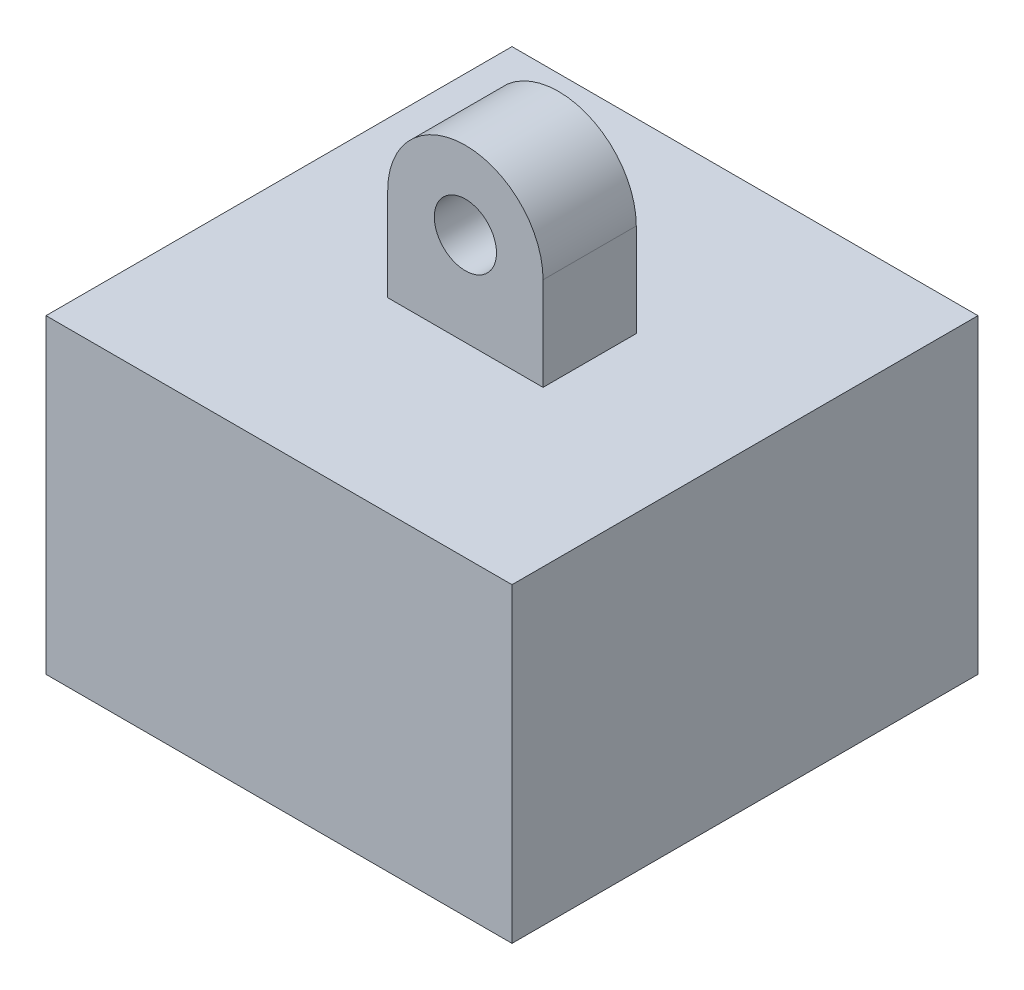
ISO-10303-21;
HEADER;
FILE_DESCRIPTION(('STEP AP214'),'2;1');
FILE_NAME('part.step','',(''),(''),'','','');
FILE_SCHEMA(('AUTOMOTIVE_DESIGN { 1 0 10303 214 1 1 1 1 }'));
ENDSEC;
DATA;
#1=APPLICATION_CONTEXT('core data for automotive mechanical design processes');
#2=APPLICATION_PROTOCOL_DEFINITION('international standard','automotive_design',2000,#1);
#3=PRODUCT_CONTEXT('',#1,'mechanical');
#4=PRODUCT('Part','Part','',(#3));
#5=PRODUCT_RELATED_PRODUCT_CATEGORY('part','',(#4));
#6=PRODUCT_DEFINITION_FORMATION('','',#4);
#7=PRODUCT_DEFINITION_CONTEXT('part definition',#1,'design');
#8=PRODUCT_DEFINITION('design','',#6,#7);
#9=PRODUCT_DEFINITION_SHAPE('','',#8);
#10=(LENGTH_UNIT() NAMED_UNIT(*) SI_UNIT(.MILLI.,.METRE.));
#11=(NAMED_UNIT(*) PLANE_ANGLE_UNIT() SI_UNIT($,.RADIAN.));
#12=(NAMED_UNIT(*) SI_UNIT($,.STERADIAN.) SOLID_ANGLE_UNIT());
#13=UNCERTAINTY_MEASURE_WITH_UNIT(LENGTH_MEASURE(1.E-05),#10,'distance_accuracy_value','');
#14=(GEOMETRIC_REPRESENTATION_CONTEXT(3) GLOBAL_UNCERTAINTY_ASSIGNED_CONTEXT((#13)) GLOBAL_UNIT_ASSIGNED_CONTEXT((#10,
#11,#12)) REPRESENTATION_CONTEXT('',''));
#15=CARTESIAN_POINT('',(0.,0.,0.));
#16=DIRECTION('',(0.,0.,1.));
#17=DIRECTION('',(1.,0.,0.));
#18=AXIS2_PLACEMENT_3D('',#15,#16,#17);
#19=CARTESIAN_POINT('',(0.,-10.,0.));
#20=DIRECTION('',(1.,0.,0.));
#21=DIRECTION('',(0.,0.,-1.));
#22=AXIS2_PLACEMENT_3D('',#19,#20,#21);
#23=PLANE('',#22);
#24=DIRECTION('',(0.,0.,-1.));
#25=VECTOR('',#24,1.);
#26=CARTESIAN_POINT('',(0.,0.,0.));
#27=LINE('',#26,#25);
#28=CARTESIAN_POINT('',(0.,0.,0.));
#29=VERTEX_POINT('',#28);
#30=CARTESIAN_POINT('',(0.,0.,-15.));
#31=VERTEX_POINT('',#30);
#32=EDGE_CURVE('E143',#29,#31,#27,.T.);
#33=ORIENTED_EDGE('',*,*,#32,.T.);
#34=DIRECTION('',(0.,1.,0.));
#35=VECTOR('',#34,1.);
#36=CARTESIAN_POINT('',(0.,-10.,-15.));
#37=LINE('',#36,#35);
#38=CARTESIAN_POINT('',(0.,-10.,-15.));
#39=VERTEX_POINT('',#38);
#40=EDGE_CURVE('E11',#39,#31,#37,.T.);
#41=ORIENTED_EDGE('',*,*,#40,.F.);
#42=DIRECTION('',(0.,0.,-1.));
#43=VECTOR('',#42,1.);
#44=CARTESIAN_POINT('',(0.,-10.,0.));
#45=LINE('',#44,#43);
#46=CARTESIAN_POINT('',(0.,-10.,0.));
#47=VERTEX_POINT('',#46);
#48=EDGE_CURVE('E154',#47,#39,#45,.T.);
#49=ORIENTED_EDGE('',*,*,#48,.F.);
#50=DIRECTION('',(0.,1.,0.));
#51=VECTOR('',#50,1.);
#52=CARTESIAN_POINT('',(0.,-10.,0.));
#53=LINE('',#52,#51);
#54=EDGE_CURVE('E163',#47,#29,#53,.T.);
#55=ORIENTED_EDGE('',*,*,#54,.T.);
#56=EDGE_LOOP('',(#33,#41,#49,#55));
#57=FACE_BOUND('',#56,.T.);
#58=ADVANCED_FACE('F41',(#57),#23,.F.);
#59=CARTESIAN_POINT('',(0.,-10.,-15.));
#60=DIRECTION('',(0.,0.,1.));
#61=DIRECTION('',(1.,0.,0.));
#62=AXIS2_PLACEMENT_3D('',#59,#60,#61);
#63=PLANE('',#62);
#64=DIRECTION('',(1.,0.,0.));
#65=VECTOR('',#64,1.);
#66=CARTESIAN_POINT('',(0.,0.,-15.));
#67=LINE('',#66,#65);
#68=CARTESIAN_POINT('',(15.,0.,-15.));
#69=VERTEX_POINT('',#68);
#70=EDGE_CURVE('E148',#31,#69,#67,.T.);
#71=ORIENTED_EDGE('',*,*,#70,.T.);
#72=DIRECTION('',(0.,1.,0.));
#73=VECTOR('',#72,1.);
#74=CARTESIAN_POINT('',(15.,-10.,-15.));
#75=LINE('',#74,#73);
#76=CARTESIAN_POINT('',(15.,-10.,-15.));
#77=VERTEX_POINT('',#76);
#78=EDGE_CURVE('E49',#77,#69,#75,.T.);
#79=ORIENTED_EDGE('',*,*,#78,.F.);
#80=DIRECTION('',(1.,0.,0.));
#81=VECTOR('',#80,1.);
#82=CARTESIAN_POINT('',(0.,-10.,-15.));
#83=LINE('',#82,#81);
#84=EDGE_CURVE('E93',#39,#77,#83,.T.);
#85=ORIENTED_EDGE('',*,*,#84,.F.);
#86=ORIENTED_EDGE('',*,*,#40,.T.);
#87=EDGE_LOOP('',(#71,#79,#85,#86));
#88=FACE_BOUND('',#87,.T.);
#89=ADVANCED_FACE('F198',(#88),#63,.F.);
#90=CARTESIAN_POINT('',(15.,-10.,0.));
#91=DIRECTION('',(-1.,0.,0.));
#92=DIRECTION('',(0.,0.,1.));
#93=AXIS2_PLACEMENT_3D('',#90,#91,#92);
#94=PLANE('',#93);
#95=DIRECTION('',(0.,0.,1.));
#96=VECTOR('',#95,1.);
#97=CARTESIAN_POINT('',(15.,0.,0.));
#98=LINE('',#97,#96);
#99=CARTESIAN_POINT('',(15.,0.,0.));
#100=VERTEX_POINT('',#99);
#101=EDGE_CURVE('E167',#69,#100,#98,.T.);
#102=ORIENTED_EDGE('',*,*,#101,.T.);
#103=DIRECTION('',(0.,1.,0.));
#104=VECTOR('',#103,1.);
#105=CARTESIAN_POINT('',(15.,-10.,0.));
#106=LINE('',#105,#104);
#107=CARTESIAN_POINT('',(15.,-10.,0.));
#108=VERTEX_POINT('',#107);
#109=EDGE_CURVE('E174',#108,#100,#106,.T.);
#110=ORIENTED_EDGE('',*,*,#109,.F.);
#111=DIRECTION('',(0.,0.,1.));
#112=VECTOR('',#111,1.);
#113=CARTESIAN_POINT('',(15.,-10.,0.));
#114=LINE('',#113,#112);
#115=EDGE_CURVE('E159',#77,#108,#114,.T.);
#116=ORIENTED_EDGE('',*,*,#115,.F.);
#117=ORIENTED_EDGE('',*,*,#78,.T.);
#118=EDGE_LOOP('',(#102,#110,#116,#117));
#119=FACE_BOUND('',#118,.T.);
#120=ADVANCED_FACE('F181',(#119),#94,.F.);
#121=CARTESIAN_POINT('',(0.,-10.,0.));
#122=DIRECTION('',(0.,0.,-1.));
#123=DIRECTION('',(-1.,0.,0.));
#124=AXIS2_PLACEMENT_3D('',#121,#122,#123);
#125=PLANE('',#124);
#126=DIRECTION('',(-1.,0.,0.));
#127=VECTOR('',#126,1.);
#128=CARTESIAN_POINT('',(0.,0.,0.));
#129=LINE('',#128,#127);
#130=EDGE_CURVE('E86',#100,#29,#129,.T.);
#131=ORIENTED_EDGE('',*,*,#130,.T.);
#132=ORIENTED_EDGE('',*,*,#54,.F.);
#133=DIRECTION('',(-1.,0.,0.));
#134=VECTOR('',#133,1.);
#135=CARTESIAN_POINT('',(0.,-10.,0.));
#136=LINE('',#135,#134);
#137=EDGE_CURVE('E65',#108,#47,#136,.T.);
#138=ORIENTED_EDGE('',*,*,#137,.F.);
#139=ORIENTED_EDGE('',*,*,#109,.T.);
#140=EDGE_LOOP('',(#131,#132,#138,#139));
#141=FACE_BOUND('',#140,.T.);
#142=ADVANCED_FACE('F189',(#141),#125,.F.);
#143=CARTESIAN_POINT('',(0.,-10.,0.));
#144=DIRECTION('',(0.,-1.,0.));
#145=DIRECTION('',(0.,0.,-1.));
#146=AXIS2_PLACEMENT_3D('',#143,#144,#145);
#147=PLANE('',#146);
#148=ORIENTED_EDGE('',*,*,#48,.T.);
#149=ORIENTED_EDGE('',*,*,#84,.T.);
#150=ORIENTED_EDGE('',*,*,#115,.T.);
#151=ORIENTED_EDGE('',*,*,#137,.T.);
#152=EDGE_LOOP('',(#148,#149,#150,#151));
#153=FACE_BOUND('',#152,.T.);
#154=ADVANCED_FACE('F191',(#153),#147,.T.);
#155=CARTESIAN_POINT('',(0.,0.,0.));
#156=DIRECTION('',(0.,-1.,0.));
#157=DIRECTION('',(0.,0.,-1.));
#158=AXIS2_PLACEMENT_3D('',#155,#156,#157);
#159=PLANE('',#158);
#160=DIRECTION('',(0.,0.,-1.));
#161=VECTOR('',#160,1.);
#162=CARTESIAN_POINT('',(5.,0.,-6.));
#163=LINE('',#162,#161);
#164=CARTESIAN_POINT('',(5.,0.,-6.));
#165=VERTEX_POINT('',#164);
#166=CARTESIAN_POINT('',(5.,0.,-9.));
#167=VERTEX_POINT('',#166);
#168=EDGE_CURVE('E123',#165,#167,#163,.T.);
#169=ORIENTED_EDGE('',*,*,#168,.T.);
#170=DIRECTION('',(1.,0.,0.));
#171=VECTOR('',#170,1.);
#172=CARTESIAN_POINT('',(0.,0.,-9.));
#173=LINE('',#172,#171);
#174=CARTESIAN_POINT('',(10.,0.,-9.));
#175=VERTEX_POINT('',#174);
#176=EDGE_CURVE('E56',#167,#175,#173,.T.);
#177=ORIENTED_EDGE('',*,*,#176,.T.);
#178=DIRECTION('',(0.,0.,-1.));
#179=VECTOR('',#178,1.);
#180=CARTESIAN_POINT('',(10.,0.,-6.));
#181=LINE('',#180,#179);
#182=CARTESIAN_POINT('',(10.,0.,-6.));
#183=VERTEX_POINT('',#182);
#184=EDGE_CURVE('E150',#183,#175,#181,.T.);
#185=ORIENTED_EDGE('',*,*,#184,.F.);
#186=DIRECTION('',(1.,0.,0.));
#187=VECTOR('',#186,1.);
#188=CARTESIAN_POINT('',(0.,0.,-6.));
#189=LINE('',#188,#187);
#190=EDGE_CURVE('E127',#165,#183,#189,.T.);
#191=ORIENTED_EDGE('',*,*,#190,.F.);
#192=EDGE_LOOP('',(#169,#177,#185,#191));
#193=FACE_BOUND('',#192,.T.);
#194=ORIENTED_EDGE('',*,*,#32,.F.);
#195=ORIENTED_EDGE('',*,*,#130,.F.);
#196=ORIENTED_EDGE('',*,*,#101,.F.);
#197=ORIENTED_EDGE('',*,*,#70,.F.);
#198=EDGE_LOOP('',(#194,#195,#196,#197));
#199=FACE_BOUND('',#198,.T.);
#200=ADVANCED_FACE('F185',(#193,#199),#159,.F.);
#201=CARTESIAN_POINT('',(7.5,3.,-6.));
#202=DIRECTION('',(0.,0.,-1.));
#203=DIRECTION('',(-1.,0.,0.));
#204=AXIS2_PLACEMENT_3D('',#201,#202,#203);
#205=CYLINDRICAL_SURFACE('',#204,2.5);
#206=CARTESIAN_POINT('',(7.5,3.,-9.));
#207=DIRECTION('',(0.,0.,1.));
#208=DIRECTION('',(1.,0.,0.));
#209=AXIS2_PLACEMENT_3D('',#206,#207,#208);
#210=CIRCLE('',#209,2.5);
#211=CARTESIAN_POINT('',(10.,3.,-9.));
#212=VERTEX_POINT('',#211);
#213=CARTESIAN_POINT('',(5.,3.,-9.));
#214=VERTEX_POINT('',#213);
#215=EDGE_CURVE('E141',#212,#214,#210,.T.);
#216=ORIENTED_EDGE('',*,*,#215,.T.);
#217=DIRECTION('',(0.,0.,-1.));
#218=VECTOR('',#217,1.);
#219=CARTESIAN_POINT('',(5.,3.,-6.));
#220=LINE('',#219,#218);
#221=CARTESIAN_POINT('',(5.,3.,-6.));
#222=VERTEX_POINT('',#221);
#223=EDGE_CURVE('E120',#222,#214,#220,.T.);
#224=ORIENTED_EDGE('',*,*,#223,.F.);
#225=CARTESIAN_POINT('',(7.5,3.,-6.));
#226=DIRECTION('',(0.,0.,1.));
#227=DIRECTION('',(1.,0.,0.));
#228=AXIS2_PLACEMENT_3D('',#225,#226,#227);
#229=CIRCLE('',#228,2.5);
#230=CARTESIAN_POINT('',(10.,3.,-6.));
#231=VERTEX_POINT('',#230);
#232=EDGE_CURVE('E128',#231,#222,#229,.T.);
#233=ORIENTED_EDGE('',*,*,#232,.F.);
#234=DIRECTION('',(0.,0.,-1.));
#235=VECTOR('',#234,1.);
#236=CARTESIAN_POINT('',(10.,3.,-6.));
#237=LINE('',#236,#235);
#238=EDGE_CURVE('E300',#231,#212,#237,.T.);
#239=ORIENTED_EDGE('',*,*,#238,.T.);
#240=EDGE_LOOP('',(#216,#224,#233,#239));
#241=FACE_BOUND('',#240,.T.);
#242=ADVANCED_FACE('F139',(#241),#205,.T.);
#243=CARTESIAN_POINT('',(5.,0.,-6.));
#244=DIRECTION('',(1.,0.,0.));
#245=DIRECTION('',(0.,1.,0.));
#246=AXIS2_PLACEMENT_3D('',#243,#244,#245);
#247=PLANE('',#246);
#248=DIRECTION('',(0.,-1.,0.));
#249=VECTOR('',#248,1.);
#250=CARTESIAN_POINT('',(5.,0.,-9.));
#251=LINE('',#250,#249);
#252=EDGE_CURVE('E297',#214,#167,#251,.T.);
#253=ORIENTED_EDGE('',*,*,#252,.T.);
#254=ORIENTED_EDGE('',*,*,#168,.F.);
#255=DIRECTION('',(0.,-1.,0.));
#256=VECTOR('',#255,1.);
#257=CARTESIAN_POINT('',(5.,0.,-6.));
#258=LINE('',#257,#256);
#259=EDGE_CURVE('E116',#222,#165,#258,.T.);
#260=ORIENTED_EDGE('',*,*,#259,.F.);
#261=ORIENTED_EDGE('',*,*,#223,.T.);
#262=EDGE_LOOP('',(#253,#254,#260,#261));
#263=FACE_BOUND('',#262,.T.);
#264=ADVANCED_FACE('F118',(#263),#247,.F.);
#265=CARTESIAN_POINT('',(7.5,3.,-6.));
#266=DIRECTION('',(0.,0.,-1.));
#267=DIRECTION('',(-1.,0.,0.));
#268=AXIS2_PLACEMENT_3D('',#265,#266,#267);
#269=CYLINDRICAL_SURFACE('',#268,1.);
#270=CARTESIAN_POINT('',(7.5,3.,-6.));
#271=DIRECTION('',(0.,0.,1.));
#272=DIRECTION('',(1.,0.,0.));
#273=AXIS2_PLACEMENT_3D('',#270,#271,#272);
#274=CIRCLE('',#273,1.);
#275=CARTESIAN_POINT('',(8.5,3.,-6.));
#276=VERTEX_POINT('',#275);
#277=EDGE_CURVE('E137',#276,#276,#274,.T.);
#278=ORIENTED_EDGE('',*,*,#277,.T.);
#279=EDGE_LOOP('',(#278));
#280=FACE_BOUND('',#279,.T.);
#281=CARTESIAN_POINT('',(7.5,3.,-9.));
#282=DIRECTION('',(0.,0.,1.));
#283=DIRECTION('',(1.,0.,0.));
#284=AXIS2_PLACEMENT_3D('',#281,#282,#283);
#285=CIRCLE('',#284,1.);
#286=CARTESIAN_POINT('',(8.5,3.,-9.));
#287=VERTEX_POINT('',#286);
#288=EDGE_CURVE('E294',#287,#287,#285,.T.);
#289=ORIENTED_EDGE('',*,*,#288,.F.);
#290=EDGE_LOOP('',(#289));
#291=FACE_BOUND('',#290,.T.);
#292=ADVANCED_FACE('F246',(#280,#291),#269,.F.);
#293=CARTESIAN_POINT('',(10.,0.,-6.));
#294=DIRECTION('',(1.,0.,0.));
#295=DIRECTION('',(0.,0.,-1.));
#296=AXIS2_PLACEMENT_3D('',#293,#294,#295);
#297=PLANE('',#296);
#298=DIRECTION('',(0.,-1.,0.));
#299=VECTOR('',#298,1.);
#300=CARTESIAN_POINT('',(10.,0.,-9.));
#301=LINE('',#300,#299);
#302=EDGE_CURVE('E296',#212,#175,#301,.T.);
#303=ORIENTED_EDGE('',*,*,#302,.F.);
#304=ORIENTED_EDGE('',*,*,#238,.F.);
#305=DIRECTION('',(0.,-1.,0.));
#306=VECTOR('',#305,1.);
#307=CARTESIAN_POINT('',(10.,0.,-6.));
#308=LINE('',#307,#306);
#309=EDGE_CURVE('E134',#231,#183,#308,.T.);
#310=ORIENTED_EDGE('',*,*,#309,.T.);
#311=ORIENTED_EDGE('',*,*,#184,.T.);
#312=EDGE_LOOP('',(#303,#304,#310,#311));
#313=FACE_BOUND('',#312,.T.);
#314=ADVANCED_FACE('F255',(#313),#297,.T.);
#315=CARTESIAN_POINT('',(0.,0.,-6.));
#316=DIRECTION('',(0.,0.,1.));
#317=DIRECTION('',(1.,0.,0.));
#318=AXIS2_PLACEMENT_3D('',#315,#316,#317);
#319=PLANE('',#318);
#320=ORIENTED_EDGE('',*,*,#277,.F.);
#321=EDGE_LOOP('',(#320));
#322=FACE_BOUND('',#321,.T.);
#323=ORIENTED_EDGE('',*,*,#232,.T.);
#324=ORIENTED_EDGE('',*,*,#259,.T.);
#325=ORIENTED_EDGE('',*,*,#190,.T.);
#326=ORIENTED_EDGE('',*,*,#309,.F.);
#327=EDGE_LOOP('',(#323,#324,#325,#326));
#328=FACE_BOUND('',#327,.T.);
#329=ADVANCED_FACE('F132',(#322,#328),#319,.T.);
#330=CARTESIAN_POINT('',(0.,0.,-9.));
#331=DIRECTION('',(0.,0.,1.));
#332=DIRECTION('',(1.,0.,0.));
#333=AXIS2_PLACEMENT_3D('',#330,#331,#332);
#334=PLANE('',#333);
#335=ORIENTED_EDGE('',*,*,#288,.T.);
#336=EDGE_LOOP('',(#335));
#337=FACE_BOUND('',#336,.T.);
#338=ORIENTED_EDGE('',*,*,#215,.F.);
#339=ORIENTED_EDGE('',*,*,#302,.T.);
#340=ORIENTED_EDGE('',*,*,#176,.F.);
#341=ORIENTED_EDGE('',*,*,#252,.F.);
#342=EDGE_LOOP('',(#338,#339,#340,#341));
#343=FACE_BOUND('',#342,.T.);
#344=ADVANCED_FACE('F275',(#337,#343),#334,.F.);
#345=CLOSED_SHELL('',(#58,#89,#120,#142,#154,#200,#242,#264,#292,#314,#329,#344));
#346=MANIFOLD_SOLID_BREP('B2',#345);
#347=ADVANCED_BREP_SHAPE_REPRESENTATION('',(#18,#346),#14);
#348=SHAPE_DEFINITION_REPRESENTATION(#9,#347);
ENDSEC;
END-ISO-10303-21;
